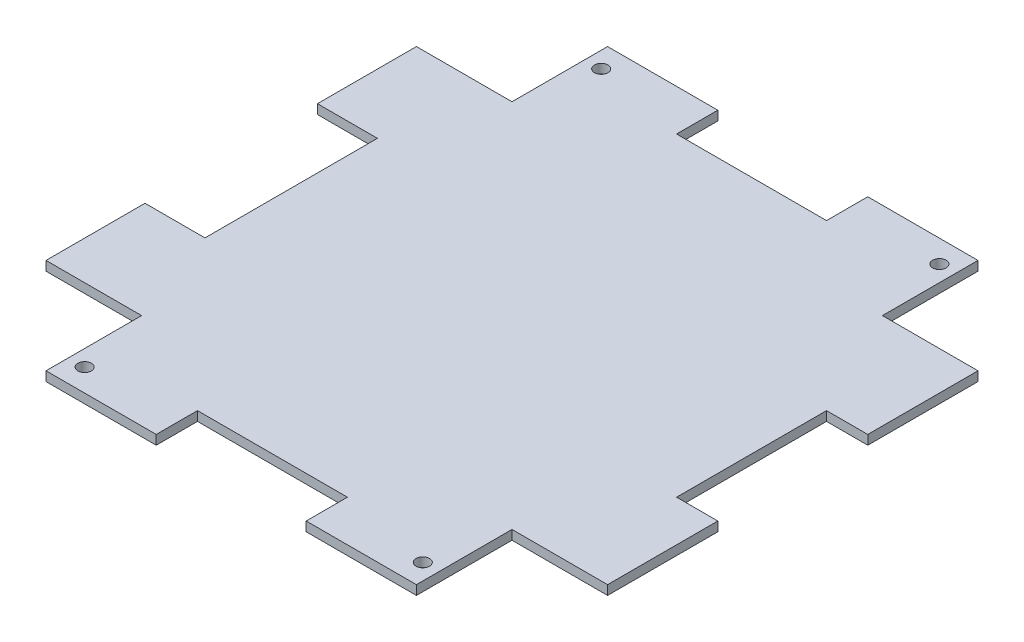
ISO-10303-21;
HEADER;
FILE_DESCRIPTION(('STEP AP214'),'2;1');
FILE_NAME('part.step','',(''),(''),'','','');
FILE_SCHEMA(('AUTOMOTIVE_DESIGN { 1 0 10303 214 1 1 1 1 }'));
ENDSEC;
DATA;
#1=APPLICATION_CONTEXT('core data for automotive mechanical design processes');
#2=APPLICATION_PROTOCOL_DEFINITION('international standard','automotive_design',2000,#1);
#3=PRODUCT_CONTEXT('',#1,'mechanical');
#4=PRODUCT('Part','Part','',(#3));
#5=PRODUCT_RELATED_PRODUCT_CATEGORY('part','',(#4));
#6=PRODUCT_DEFINITION_FORMATION('','',#4);
#7=PRODUCT_DEFINITION_CONTEXT('part definition',#1,'design');
#8=PRODUCT_DEFINITION('design','',#6,#7);
#9=PRODUCT_DEFINITION_SHAPE('','',#8);
#10=(LENGTH_UNIT() NAMED_UNIT(*) SI_UNIT(.MILLI.,.METRE.));
#11=(NAMED_UNIT(*) PLANE_ANGLE_UNIT() SI_UNIT($,.RADIAN.));
#12=(NAMED_UNIT(*) SI_UNIT($,.STERADIAN.) SOLID_ANGLE_UNIT());
#13=UNCERTAINTY_MEASURE_WITH_UNIT(LENGTH_MEASURE(1.E-05),#10,'distance_accuracy_value','');
#14=(GEOMETRIC_REPRESENTATION_CONTEXT(3) GLOBAL_UNCERTAINTY_ASSIGNED_CONTEXT((#13)) GLOBAL_UNIT_ASSIGNED_CONTEXT((#10,
#11,#12)) REPRESENTATION_CONTEXT('',''));
#15=CARTESIAN_POINT('',(0.,0.,0.));
#16=DIRECTION('',(0.,0.,1.));
#17=DIRECTION('',(1.,0.,0.));
#18=AXIS2_PLACEMENT_3D('',#15,#16,#17);
#19=CARTESIAN_POINT('',(-62.22816,3.175,-57.16896));
#20=DIRECTION('',(1.,0.,0.));
#21=DIRECTION('',(0.,0.,-1.));
#22=AXIS2_PLACEMENT_3D('',#19,#20,#21);
#23=PLANE('',#22);
#24=DIRECTION('',(0.,0.,1.));
#25=VECTOR('',#24,1.);
#26=CARTESIAN_POINT('',(-62.22816,0.,-57.16896));
#27=LINE('',#26,#25);
#28=CARTESIAN_POINT('',(-62.22816,0.,-57.16896));
#29=VERTEX_POINT('',#28);
#30=CARTESIAN_POINT('',(-62.22816,0.,-23.63596));
#31=VERTEX_POINT('',#30);
#32=EDGE_CURVE('E250',#29,#31,#27,.T.);
#33=ORIENTED_EDGE('',*,*,#32,.T.);
#34=DIRECTION('',(0.,1.,0.));
#35=VECTOR('',#34,1.);
#36=CARTESIAN_POINT('',(-62.22816,0.,-23.63596));
#37=LINE('',#36,#35);
#38=CARTESIAN_POINT('',(-62.22816,3.175,-23.63596));
#39=VERTEX_POINT('',#38);
#40=EDGE_CURVE('E410',#31,#39,#37,.T.);
#41=ORIENTED_EDGE('',*,*,#40,.T.);
#42=DIRECTION('',(0.,0.,1.));
#43=VECTOR('',#42,1.);
#44=CARTESIAN_POINT('',(-62.22816,3.175,-57.16896));
#45=LINE('',#44,#43);
#46=CARTESIAN_POINT('',(-62.22816,3.175,-57.16896));
#47=VERTEX_POINT('',#46);
#48=EDGE_CURVE('E403',#47,#39,#45,.T.);
#49=ORIENTED_EDGE('',*,*,#48,.F.);
#50=DIRECTION('',(0.,-1.,0.));
#51=VECTOR('',#50,1.);
#52=CARTESIAN_POINT('',(-62.22816,3.175,-57.16896));
#53=LINE('',#52,#51);
#54=EDGE_CURVE('E301',#47,#29,#53,.T.);
#55=ORIENTED_EDGE('',*,*,#54,.T.);
#56=EDGE_LOOP('',(#33,#41,#49,#55));
#57=FACE_BOUND('',#56,.T.);
#58=ADVANCED_FACE('F39',(#57),#23,.F.);
#59=CARTESIAN_POINT('',(-29.84616,3.175,100.69904));
#60=DIRECTION('',(0.,0.,-1.));
#61=DIRECTION('',(-1.,0.,0.));
#62=AXIS2_PLACEMENT_3D('',#59,#60,#61);
#63=PLANE('',#62);
#64=DIRECTION('',(1.,0.,0.));
#65=VECTOR('',#64,1.);
#66=CARTESIAN_POINT('',(-29.84616,3.175,100.69904));
#67=LINE('',#66,#65);
#68=CARTESIAN_POINT('',(58.29684,3.175,100.69904));
#69=VERTEX_POINT('',#68);
#70=CARTESIAN_POINT('',(95.63984,3.175,100.69904));
#71=VERTEX_POINT('',#70);
#72=EDGE_CURVE('E365',#69,#71,#67,.T.);
#73=ORIENTED_EDGE('',*,*,#72,.F.);
#74=DIRECTION('',(0.,1.,0.));
#75=VECTOR('',#74,1.);
#76=CARTESIAN_POINT('',(58.29684,0.,100.69904));
#77=LINE('',#76,#75);
#78=CARTESIAN_POINT('',(58.29684,0.,100.69904));
#79=VERTEX_POINT('',#78);
#80=EDGE_CURVE('E452',#79,#69,#77,.T.);
#81=ORIENTED_EDGE('',*,*,#80,.F.);
#82=DIRECTION('',(1.,0.,0.));
#83=VECTOR('',#82,1.);
#84=CARTESIAN_POINT('',(-29.84616,0.,100.69904));
#85=LINE('',#84,#83);
#86=CARTESIAN_POINT('',(95.63984,0.,100.69904));
#87=VERTEX_POINT('',#86);
#88=EDGE_CURVE('E268',#79,#87,#85,.T.);
#89=ORIENTED_EDGE('',*,*,#88,.T.);
#90=DIRECTION('',(0.,-1.,0.));
#91=VECTOR('',#90,1.);
#92=CARTESIAN_POINT('',(95.63984,3.175,100.69904));
#93=LINE('',#92,#91);
#94=EDGE_CURVE('E333',#71,#87,#93,.T.);
#95=ORIENTED_EDGE('',*,*,#94,.F.);
#96=EDGE_LOOP('',(#73,#81,#89,#95));
#97=FACE_BOUND('',#96,.T.);
#98=ADVANCED_FACE('F580',(#97),#63,.F.);
#99=CARTESIAN_POINT('',(128.02184,3.175,68.31704));
#100=DIRECTION('',(-1.,0.,0.));
#101=DIRECTION('',(0.,0.,1.));
#102=AXIS2_PLACEMENT_3D('',#99,#100,#101);
#103=PLANE('',#102);
#104=DIRECTION('',(0.,0.,-1.));
#105=VECTOR('',#104,1.);
#106=CARTESIAN_POINT('',(128.02184,0.,68.31704));
#107=LINE('',#106,#105);
#108=CARTESIAN_POINT('',(128.02184,0.,68.31704));
#109=VERTEX_POINT('',#108);
#110=CARTESIAN_POINT('',(128.02184,0.,30.97404));
#111=VERTEX_POINT('',#110);
#112=EDGE_CURVE('E280',#109,#111,#107,.T.);
#113=ORIENTED_EDGE('',*,*,#112,.T.);
#114=DIRECTION('',(0.,1.,0.));
#115=VECTOR('',#114,1.);
#116=CARTESIAN_POINT('',(128.02184,0.,30.97404));
#117=LINE('',#116,#115);
#118=CARTESIAN_POINT('',(128.02184,3.175,30.97404));
#119=VERTEX_POINT('',#118);
#120=EDGE_CURVE('E486',#111,#119,#117,.T.);
#121=ORIENTED_EDGE('',*,*,#120,.T.);
#122=DIRECTION('',(0.,0.,-1.));
#123=VECTOR('',#122,1.);
#124=CARTESIAN_POINT('',(128.02184,3.175,68.31704));
#125=LINE('',#124,#123);
#126=CARTESIAN_POINT('',(128.02184,3.175,68.31704));
#127=VERTEX_POINT('',#126);
#128=EDGE_CURVE('E377',#127,#119,#125,.T.);
#129=ORIENTED_EDGE('',*,*,#128,.F.);
#130=DIRECTION('',(0.,-1.,0.));
#131=VECTOR('',#130,1.);
#132=CARTESIAN_POINT('',(128.02184,3.175,68.31704));
#133=LINE('',#132,#131);
#134=EDGE_CURVE('E325',#127,#109,#133,.T.);
#135=ORIENTED_EDGE('',*,*,#134,.T.);
#136=EDGE_LOOP('',(#113,#121,#129,#135));
#137=FACE_BOUND('',#136,.T.);
#138=ADVANCED_FACE('F584',(#137),#103,.F.);
#139=CARTESIAN_POINT('',(95.63984,3.175,-89.55096));
#140=DIRECTION('',(0.,0.,1.));
#141=DIRECTION('',(1.,0.,0.));
#142=AXIS2_PLACEMENT_3D('',#139,#140,#141);
#143=PLANE('',#142);
#144=DIRECTION('',(-1.,0.,0.));
#145=VECTOR('',#144,1.);
#146=CARTESIAN_POINT('',(95.63984,3.175,-89.55096));
#147=LINE('',#146,#145);
#148=CARTESIAN_POINT('',(7.49683999999999,3.175,-89.55096));
#149=VERTEX_POINT('',#148);
#150=CARTESIAN_POINT('',(-29.84616,3.175,-89.55096));
#151=VERTEX_POINT('',#150);
#152=EDGE_CURVE('E387',#149,#151,#147,.T.);
#153=ORIENTED_EDGE('',*,*,#152,.F.);
#154=DIRECTION('',(0.,1.,0.));
#155=VECTOR('',#154,1.);
#156=CARTESIAN_POINT('',(7.49683999999999,0.,-89.55096));
#157=LINE('',#156,#155);
#158=CARTESIAN_POINT('',(7.49683999999999,0.,-89.55096));
#159=VERTEX_POINT('',#158);
#160=EDGE_CURVE('E522',#159,#149,#157,.T.);
#161=ORIENTED_EDGE('',*,*,#160,.F.);
#162=DIRECTION('',(-1.,0.,0.));
#163=VECTOR('',#162,1.);
#164=CARTESIAN_POINT('',(95.63984,0.,-89.55096));
#165=LINE('',#164,#163);
#166=CARTESIAN_POINT('',(-29.84616,0.,-89.55096));
#167=VERTEX_POINT('',#166);
#168=EDGE_CURVE('E290',#159,#167,#165,.T.);
#169=ORIENTED_EDGE('',*,*,#168,.T.);
#170=DIRECTION('',(0.,-1.,0.));
#171=VECTOR('',#170,1.);
#172=CARTESIAN_POINT('',(-29.84616,3.175,-89.55096));
#173=LINE('',#172,#171);
#174=EDGE_CURVE('E309',#151,#167,#173,.T.);
#175=ORIENTED_EDGE('',*,*,#174,.F.);
#176=EDGE_LOOP('',(#153,#161,#169,#175));
#177=FACE_BOUND('',#176,.T.);
#178=ADVANCED_FACE('F589',(#177),#143,.F.);
#179=CARTESIAN_POINT('',(-62.22816,3.175,34.78404));
#180=VERTEX_POINT('',#179);
#181=CARTESIAN_POINT('',(-62.22816,3.175,68.31704));
#182=VERTEX_POINT('',#181);
#183=EDGE_CURVE('E241',#180,#182,#45,.T.);
#184=ORIENTED_EDGE('',*,*,#183,.F.);
#185=DIRECTION('',(0.,1.,0.));
#186=VECTOR('',#185,1.);
#187=CARTESIAN_POINT('',(-62.22816,0.,34.78404));
#188=LINE('',#187,#186);
#189=CARTESIAN_POINT('',(-62.22816,0.,34.78404));
#190=VERTEX_POINT('',#189);
#191=EDGE_CURVE('E228',#190,#180,#188,.T.);
#192=ORIENTED_EDGE('',*,*,#191,.F.);
#193=CARTESIAN_POINT('',(-62.22816,0.,68.31704));
#194=VERTEX_POINT('',#193);
#195=EDGE_CURVE('E239',#190,#194,#27,.T.);
#196=ORIENTED_EDGE('',*,*,#195,.T.);
#197=DIRECTION('',(0.,-1.,0.));
#198=VECTOR('',#197,1.);
#199=CARTESIAN_POINT('',(-62.22816,3.175,68.31704));
#200=LINE('',#199,#198);
#201=EDGE_CURVE('E11',#182,#194,#200,.T.);
#202=ORIENTED_EDGE('',*,*,#201,.F.);
#203=EDGE_LOOP('',(#184,#192,#196,#202));
#204=FACE_BOUND('',#203,.T.);
#205=ADVANCED_FACE('F41',(#204),#23,.F.);
#206=CARTESIAN_POINT('',(-62.22816,3.175,68.31704));
#207=DIRECTION('',(0.,0.,-1.));
#208=DIRECTION('',(-1.,0.,0.));
#209=AXIS2_PLACEMENT_3D('',#206,#207,#208);
#210=PLANE('',#209);
#211=DIRECTION('',(1.,0.,0.));
#212=VECTOR('',#211,1.);
#213=CARTESIAN_POINT('',(-62.22816,0.,68.31704));
#214=LINE('',#213,#212);
#215=CARTESIAN_POINT('',(-29.84616,0.,68.31704));
#216=VERTEX_POINT('',#215);
#217=EDGE_CURVE('E248',#194,#216,#214,.T.);
#218=ORIENTED_EDGE('',*,*,#217,.T.);
#219=DIRECTION('',(0.,-1.,0.));
#220=VECTOR('',#219,1.);
#221=CARTESIAN_POINT('',(-29.84616,3.175,68.31704));
#222=LINE('',#221,#220);
#223=CARTESIAN_POINT('',(-29.84616,3.175,68.31704));
#224=VERTEX_POINT('',#223);
#225=EDGE_CURVE('E48',#224,#216,#222,.T.);
#226=ORIENTED_EDGE('',*,*,#225,.F.);
#227=DIRECTION('',(1.,0.,0.));
#228=VECTOR('',#227,1.);
#229=CARTESIAN_POINT('',(-62.22816,3.175,68.31704));
#230=LINE('',#229,#228);
#231=EDGE_CURVE('E412',#182,#224,#230,.T.);
#232=ORIENTED_EDGE('',*,*,#231,.F.);
#233=ORIENTED_EDGE('',*,*,#201,.T.);
#234=EDGE_LOOP('',(#218,#226,#232,#233));
#235=FACE_BOUND('',#234,.T.);
#236=ADVANCED_FACE('F588',(#235),#210,.F.);
#237=CARTESIAN_POINT('',(-29.84616,3.175,68.31704));
#238=DIRECTION('',(1.,0.,0.));
#239=DIRECTION('',(0.,0.,-1.));
#240=AXIS2_PLACEMENT_3D('',#237,#238,#239);
#241=PLANE('',#240);
#242=DIRECTION('',(0.,0.,1.));
#243=VECTOR('',#242,1.);
#244=CARTESIAN_POINT('',(-29.84616,0.,68.31704));
#245=LINE('',#244,#243);
#246=CARTESIAN_POINT('',(-29.84616,0.,100.69904));
#247=VERTEX_POINT('',#246);
#248=EDGE_CURVE('E265',#216,#247,#245,.T.);
#249=ORIENTED_EDGE('',*,*,#248,.T.);
#250=DIRECTION('',(0.,-1.,0.));
#251=VECTOR('',#250,1.);
#252=CARTESIAN_POINT('',(-29.84616,3.175,100.69904));
#253=LINE('',#252,#251);
#254=CARTESIAN_POINT('',(-29.84616,3.175,100.69904));
#255=VERTEX_POINT('',#254);
#256=EDGE_CURVE('E337',#255,#247,#253,.T.);
#257=ORIENTED_EDGE('',*,*,#256,.F.);
#258=DIRECTION('',(0.,0.,1.));
#259=VECTOR('',#258,1.);
#260=CARTESIAN_POINT('',(-29.84616,3.175,68.31704));
#261=LINE('',#260,#259);
#262=EDGE_CURVE('E347',#224,#255,#261,.T.);
#263=ORIENTED_EDGE('',*,*,#262,.F.);
#264=ORIENTED_EDGE('',*,*,#225,.T.);
#265=EDGE_LOOP('',(#249,#257,#263,#264));
#266=FACE_BOUND('',#265,.T.);
#267=ADVANCED_FACE('F345',(#266),#241,.F.);
#268=CARTESIAN_POINT('',(7.49683999999999,0.,100.69904));
#269=VERTEX_POINT('',#268);
#270=EDGE_CURVE('E269',#247,#269,#85,.T.);
#271=ORIENTED_EDGE('',*,*,#270,.T.);
#272=DIRECTION('',(0.,1.,0.));
#273=VECTOR('',#272,1.);
#274=CARTESIAN_POINT('',(7.49683999999999,0.,100.69904));
#275=LINE('',#274,#273);
#276=CARTESIAN_POINT('',(7.49683999999999,3.175,100.69904));
#277=VERTEX_POINT('',#276);
#278=EDGE_CURVE('E358',#269,#277,#275,.T.);
#279=ORIENTED_EDGE('',*,*,#278,.T.);
#280=EDGE_CURVE('E360',#255,#277,#67,.T.);
#281=ORIENTED_EDGE('',*,*,#280,.F.);
#282=ORIENTED_EDGE('',*,*,#256,.T.);
#283=EDGE_LOOP('',(#271,#279,#281,#282));
#284=FACE_BOUND('',#283,.T.);
#285=ADVANCED_FACE('F356',(#284),#63,.F.);
#286=CARTESIAN_POINT('',(95.63984,3.175,100.69904));
#287=DIRECTION('',(-1.,0.,0.));
#288=DIRECTION('',(0.,0.,1.));
#289=AXIS2_PLACEMENT_3D('',#286,#287,#288);
#290=PLANE('',#289);
#291=DIRECTION('',(0.,0.,-1.));
#292=VECTOR('',#291,1.);
#293=CARTESIAN_POINT('',(95.63984,0.,100.69904));
#294=LINE('',#293,#292);
#295=CARTESIAN_POINT('',(95.63984,0.,68.31704));
#296=VERTEX_POINT('',#295);
#297=EDGE_CURVE('E273',#87,#296,#294,.T.);
#298=ORIENTED_EDGE('',*,*,#297,.T.);
#299=DIRECTION('',(0.,-1.,0.));
#300=VECTOR('',#299,1.);
#301=CARTESIAN_POINT('',(95.63984,3.175,68.31704));
#302=LINE('',#301,#300);
#303=CARTESIAN_POINT('',(95.63984,3.175,68.31704));
#304=VERTEX_POINT('',#303);
#305=EDGE_CURVE('E329',#304,#296,#302,.T.);
#306=ORIENTED_EDGE('',*,*,#305,.F.);
#307=DIRECTION('',(0.,0.,-1.));
#308=VECTOR('',#307,1.);
#309=CARTESIAN_POINT('',(95.63984,3.175,100.69904));
#310=LINE('',#309,#308);
#311=EDGE_CURVE('E364',#71,#304,#310,.T.);
#312=ORIENTED_EDGE('',*,*,#311,.F.);
#313=ORIENTED_EDGE('',*,*,#94,.T.);
#314=EDGE_LOOP('',(#298,#306,#312,#313));
#315=FACE_BOUND('',#314,.T.);
#316=ADVANCED_FACE('F646',(#315),#290,.F.);
#317=CARTESIAN_POINT('',(95.63984,3.175,68.31704));
#318=DIRECTION('',(0.,0.,-1.));
#319=DIRECTION('',(-1.,0.,0.));
#320=AXIS2_PLACEMENT_3D('',#317,#318,#319);
#321=PLANE('',#320);
#322=DIRECTION('',(1.,0.,0.));
#323=VECTOR('',#322,1.);
#324=CARTESIAN_POINT('',(95.63984,0.,68.31704));
#325=LINE('',#324,#323);
#326=EDGE_CURVE('E276',#296,#109,#325,.T.);
#327=ORIENTED_EDGE('',*,*,#326,.T.);
#328=ORIENTED_EDGE('',*,*,#134,.F.);
#329=DIRECTION('',(1.,0.,0.));
#330=VECTOR('',#329,1.);
#331=CARTESIAN_POINT('',(95.63984,3.175,68.31704));
#332=LINE('',#331,#330);
#333=EDGE_CURVE('E369',#304,#127,#332,.T.);
#334=ORIENTED_EDGE('',*,*,#333,.F.);
#335=ORIENTED_EDGE('',*,*,#305,.T.);
#336=EDGE_LOOP('',(#327,#328,#334,#335));
#337=FACE_BOUND('',#336,.T.);
#338=ADVANCED_FACE('F652',(#337),#321,.F.);
#339=CARTESIAN_POINT('',(128.02184,3.175,-19.82596));
#340=VERTEX_POINT('',#339);
#341=CARTESIAN_POINT('',(128.02184,3.175,-57.16896));
#342=VERTEX_POINT('',#341);
#343=EDGE_CURVE('E376',#340,#342,#125,.T.);
#344=ORIENTED_EDGE('',*,*,#343,.F.);
#345=DIRECTION('',(0.,1.,0.));
#346=VECTOR('',#345,1.);
#347=CARTESIAN_POINT('',(128.02184,0.,-19.82596));
#348=LINE('',#347,#346);
#349=CARTESIAN_POINT('',(128.02184,0.,-19.82596));
#350=VERTEX_POINT('',#349);
#351=EDGE_CURVE('E476',#350,#340,#348,.T.);
#352=ORIENTED_EDGE('',*,*,#351,.F.);
#353=CARTESIAN_POINT('',(128.02184,0.,-57.16896));
#354=VERTEX_POINT('',#353);
#355=EDGE_CURVE('E279',#350,#354,#107,.T.);
#356=ORIENTED_EDGE('',*,*,#355,.T.);
#357=DIRECTION('',(0.,-1.,0.));
#358=VECTOR('',#357,1.);
#359=CARTESIAN_POINT('',(128.02184,3.175,-57.16896));
#360=LINE('',#359,#358);
#361=EDGE_CURVE('E321',#342,#354,#360,.T.);
#362=ORIENTED_EDGE('',*,*,#361,.F.);
#363=EDGE_LOOP('',(#344,#352,#356,#362));
#364=FACE_BOUND('',#363,.T.);
#365=ADVANCED_FACE('F602',(#364),#103,.F.);
#366=CARTESIAN_POINT('',(128.02184,3.175,-57.16896));
#367=DIRECTION('',(0.,0.,1.));
#368=DIRECTION('',(1.,0.,0.));
#369=AXIS2_PLACEMENT_3D('',#366,#367,#368);
#370=PLANE('',#369);
#371=DIRECTION('',(-1.,0.,0.));
#372=VECTOR('',#371,1.);
#373=CARTESIAN_POINT('',(128.02184,0.,-57.16896));
#374=LINE('',#373,#372);
#375=CARTESIAN_POINT('',(95.63984,0.,-57.16896));
#376=VERTEX_POINT('',#375);
#377=EDGE_CURVE('E284',#354,#376,#374,.T.);
#378=ORIENTED_EDGE('',*,*,#377,.T.);
#379=DIRECTION('',(0.,-1.,0.));
#380=VECTOR('',#379,1.);
#381=CARTESIAN_POINT('',(95.63984,3.175,-57.16896));
#382=LINE('',#381,#380);
#383=CARTESIAN_POINT('',(95.63984,3.175,-57.16896));
#384=VERTEX_POINT('',#383);
#385=EDGE_CURVE('E317',#384,#376,#382,.T.);
#386=ORIENTED_EDGE('',*,*,#385,.F.);
#387=DIRECTION('',(-1.,0.,0.));
#388=VECTOR('',#387,1.);
#389=CARTESIAN_POINT('',(128.02184,3.175,-57.16896));
#390=LINE('',#389,#388);
#391=EDGE_CURVE('E381',#342,#384,#390,.T.);
#392=ORIENTED_EDGE('',*,*,#391,.F.);
#393=ORIENTED_EDGE('',*,*,#361,.T.);
#394=EDGE_LOOP('',(#378,#386,#392,#393));
#395=FACE_BOUND('',#394,.T.);
#396=ADVANCED_FACE('F615',(#395),#370,.F.);
#397=CARTESIAN_POINT('',(95.63984,3.175,-57.16896));
#398=DIRECTION('',(-1.,0.,0.));
#399=DIRECTION('',(0.,0.,1.));
#400=AXIS2_PLACEMENT_3D('',#397,#398,#399);
#401=PLANE('',#400);
#402=DIRECTION('',(0.,0.,-1.));
#403=VECTOR('',#402,1.);
#404=CARTESIAN_POINT('',(95.63984,0.,-57.16896));
#405=LINE('',#404,#403);
#406=CARTESIAN_POINT('',(95.63984,0.,-89.55096));
#407=VERTEX_POINT('',#406);
#408=EDGE_CURVE('E287',#376,#407,#405,.T.);
#409=ORIENTED_EDGE('',*,*,#408,.T.);
#410=DIRECTION('',(0.,-1.,0.));
#411=VECTOR('',#410,1.);
#412=CARTESIAN_POINT('',(95.63984,3.175,-89.55096));
#413=LINE('',#412,#411);
#414=CARTESIAN_POINT('',(95.63984,3.175,-89.55096));
#415=VERTEX_POINT('',#414);
#416=EDGE_CURVE('E313',#415,#407,#413,.T.);
#417=ORIENTED_EDGE('',*,*,#416,.F.);
#418=DIRECTION('',(0.,0.,-1.));
#419=VECTOR('',#418,1.);
#420=CARTESIAN_POINT('',(95.63984,3.175,-57.16896));
#421=LINE('',#420,#419);
#422=EDGE_CURVE('E384',#384,#415,#421,.T.);
#423=ORIENTED_EDGE('',*,*,#422,.F.);
#424=ORIENTED_EDGE('',*,*,#385,.T.);
#425=EDGE_LOOP('',(#409,#417,#423,#424));
#426=FACE_BOUND('',#425,.T.);
#427=ADVANCED_FACE('F608',(#426),#401,.F.);
#428=CARTESIAN_POINT('',(58.29684,0.,-89.55096));
#429=VERTEX_POINT('',#428);
#430=EDGE_CURVE('E291',#407,#429,#165,.T.);
#431=ORIENTED_EDGE('',*,*,#430,.T.);
#432=DIRECTION('',(0.,1.,0.));
#433=VECTOR('',#432,1.);
#434=CARTESIAN_POINT('',(58.29684,0.,-89.55096));
#435=LINE('',#434,#433);
#436=CARTESIAN_POINT('',(58.29684,3.175,-89.55096));
#437=VERTEX_POINT('',#436);
#438=EDGE_CURVE('E518',#429,#437,#435,.T.);
#439=ORIENTED_EDGE('',*,*,#438,.T.);
#440=EDGE_CURVE('E388',#415,#437,#147,.T.);
#441=ORIENTED_EDGE('',*,*,#440,.F.);
#442=ORIENTED_EDGE('',*,*,#416,.T.);
#443=EDGE_LOOP('',(#431,#439,#441,#442));
#444=FACE_BOUND('',#443,.T.);
#445=ADVANCED_FACE('F596',(#444),#143,.F.);
#446=CARTESIAN_POINT('',(-29.84616,3.175,-89.55096));
#447=DIRECTION('',(1.,0.,0.));
#448=DIRECTION('',(0.,0.,-1.));
#449=AXIS2_PLACEMENT_3D('',#446,#447,#448);
#450=PLANE('',#449);
#451=DIRECTION('',(0.,0.,1.));
#452=VECTOR('',#451,1.);
#453=CARTESIAN_POINT('',(-29.84616,0.,-89.55096));
#454=LINE('',#453,#452);
#455=CARTESIAN_POINT('',(-29.84616,0.,-57.16896));
#456=VERTEX_POINT('',#455);
#457=EDGE_CURVE('E295',#167,#456,#454,.T.);
#458=ORIENTED_EDGE('',*,*,#457,.T.);
#459=DIRECTION('',(0.,-1.,0.));
#460=VECTOR('',#459,1.);
#461=CARTESIAN_POINT('',(-29.84616,3.175,-57.16896));
#462=LINE('',#461,#460);
#463=CARTESIAN_POINT('',(-29.84616,3.175,-57.16896));
#464=VERTEX_POINT('',#463);
#465=EDGE_CURVE('E305',#464,#456,#462,.T.);
#466=ORIENTED_EDGE('',*,*,#465,.F.);
#467=DIRECTION('',(0.,0.,1.));
#468=VECTOR('',#467,1.);
#469=CARTESIAN_POINT('',(-29.84616,3.175,-89.55096));
#470=LINE('',#469,#468);
#471=EDGE_CURVE('E391',#151,#464,#470,.T.);
#472=ORIENTED_EDGE('',*,*,#471,.F.);
#473=ORIENTED_EDGE('',*,*,#174,.T.);
#474=EDGE_LOOP('',(#458,#466,#472,#473));
#475=FACE_BOUND('',#474,.T.);
#476=ADVANCED_FACE('F607',(#475),#450,.F.);
#477=CARTESIAN_POINT('',(-29.84616,3.175,-57.16896));
#478=DIRECTION('',(0.,0.,1.));
#479=DIRECTION('',(1.,0.,0.));
#480=AXIS2_PLACEMENT_3D('',#477,#478,#479);
#481=PLANE('',#480);
#482=DIRECTION('',(-1.,0.,0.));
#483=VECTOR('',#482,1.);
#484=CARTESIAN_POINT('',(-29.84616,0.,-57.16896));
#485=LINE('',#484,#483);
#486=EDGE_CURVE('E298',#456,#29,#485,.T.);
#487=ORIENTED_EDGE('',*,*,#486,.T.);
#488=ORIENTED_EDGE('',*,*,#54,.F.);
#489=DIRECTION('',(-1.,0.,0.));
#490=VECTOR('',#489,1.);
#491=CARTESIAN_POINT('',(-29.84616,3.175,-57.16896));
#492=LINE('',#491,#490);
#493=EDGE_CURVE('E261',#464,#47,#492,.T.);
#494=ORIENTED_EDGE('',*,*,#493,.F.);
#495=ORIENTED_EDGE('',*,*,#465,.T.);
#496=EDGE_LOOP('',(#487,#488,#494,#495));
#497=FACE_BOUND('',#496,.T.);
#498=ADVANCED_FACE('F405',(#497),#481,.F.);
#499=CARTESIAN_POINT('',(0.,3.175,0.));
#500=DIRECTION('',(0.,1.,0.));
#501=DIRECTION('',(0.,0.,1.));
#502=AXIS2_PLACEMENT_3D('',#499,#500,#501);
#503=PLANE('',#502);
#504=DIRECTION('',(-1.,0.,0.));
#505=VECTOR('',#504,1.);
#506=CARTESIAN_POINT('',(-62.22816,3.175,-23.63596));
#507=LINE('',#506,#505);
#508=CARTESIAN_POINT('',(-41.90816,3.175,-23.63596));
#509=VERTEX_POINT('',#508);
#510=EDGE_CURVE('E234',#509,#39,#507,.T.);
#511=ORIENTED_EDGE('',*,*,#510,.F.);
#512=DIRECTION('',(0.,0.,-1.));
#513=VECTOR('',#512,1.);
#514=CARTESIAN_POINT('',(-41.90816,3.175,34.78404));
#515=LINE('',#514,#513);
#516=CARTESIAN_POINT('',(-41.90816,3.175,34.78404));
#517=VERTEX_POINT('',#516);
#518=EDGE_CURVE('E555',#517,#509,#515,.T.);
#519=ORIENTED_EDGE('',*,*,#518,.F.);
#520=DIRECTION('',(1.,0.,0.));
#521=VECTOR('',#520,1.);
#522=CARTESIAN_POINT('',(-62.22816,3.175,34.78404));
#523=LINE('',#522,#521);
#524=EDGE_CURVE('E525',#180,#517,#523,.T.);
#525=ORIENTED_EDGE('',*,*,#524,.F.);
#526=ORIENTED_EDGE('',*,*,#183,.T.);
#527=ORIENTED_EDGE('',*,*,#231,.T.);
#528=ORIENTED_EDGE('',*,*,#262,.T.);
#529=ORIENTED_EDGE('',*,*,#280,.T.);
#530=DIRECTION('',(0.,0.,1.));
#531=VECTOR('',#530,1.);
#532=CARTESIAN_POINT('',(7.49683999999999,3.175,100.69904));
#533=LINE('',#532,#531);
#534=CARTESIAN_POINT('',(7.49683999999999,3.175,86.72904));
#535=VERTEX_POINT('',#534);
#536=EDGE_CURVE('E456',#535,#277,#533,.T.);
#537=ORIENTED_EDGE('',*,*,#536,.F.);
#538=DIRECTION('',(-1.,0.,0.));
#539=VECTOR('',#538,1.);
#540=CARTESIAN_POINT('',(58.29684,3.175,86.72904));
#541=LINE('',#540,#539);
#542=CARTESIAN_POINT('',(58.29684,3.175,86.72904));
#543=VERTEX_POINT('',#542);
#544=EDGE_CURVE('E460',#543,#535,#541,.T.);
#545=ORIENTED_EDGE('',*,*,#544,.F.);
#546=DIRECTION('',(0.,0.,-1.));
#547=VECTOR('',#546,1.);
#548=CARTESIAN_POINT('',(58.29684,3.175,100.69904));
#549=LINE('',#548,#547);
#550=EDGE_CURVE('E464',#69,#543,#549,.T.);
#551=ORIENTED_EDGE('',*,*,#550,.F.);
#552=ORIENTED_EDGE('',*,*,#72,.T.);
#553=ORIENTED_EDGE('',*,*,#311,.T.);
#554=ORIENTED_EDGE('',*,*,#333,.T.);
#555=ORIENTED_EDGE('',*,*,#128,.T.);
#556=DIRECTION('',(1.,0.,0.));
#557=VECTOR('',#556,1.);
#558=CARTESIAN_POINT('',(128.02184,3.175,30.97404));
#559=LINE('',#558,#557);
#560=CARTESIAN_POINT('',(114.05184,3.175,30.97404));
#561=VERTEX_POINT('',#560);
#562=EDGE_CURVE('E491',#561,#119,#559,.T.);
#563=ORIENTED_EDGE('',*,*,#562,.F.);
#564=DIRECTION('',(0.,0.,1.));
#565=VECTOR('',#564,1.);
#566=CARTESIAN_POINT('',(114.05184,3.175,-19.82596));
#567=LINE('',#566,#565);
#568=CARTESIAN_POINT('',(114.05184,3.175,-19.82596));
#569=VERTEX_POINT('',#568);
#570=EDGE_CURVE('E495',#569,#561,#567,.T.);
#571=ORIENTED_EDGE('',*,*,#570,.F.);
#572=DIRECTION('',(-1.,0.,0.));
#573=VECTOR('',#572,1.);
#574=CARTESIAN_POINT('',(128.02184,3.175,-19.82596));
#575=LINE('',#574,#573);
#576=EDGE_CURVE('E455',#340,#569,#575,.T.);
#577=ORIENTED_EDGE('',*,*,#576,.F.);
#578=ORIENTED_EDGE('',*,*,#343,.T.);
#579=ORIENTED_EDGE('',*,*,#391,.T.);
#580=ORIENTED_EDGE('',*,*,#422,.T.);
#581=ORIENTED_EDGE('',*,*,#440,.T.);
#582=DIRECTION('',(0.,0.,-1.));
#583=VECTOR('',#582,1.);
#584=CARTESIAN_POINT('',(58.29684,3.175,-89.55096));
#585=LINE('',#584,#583);
#586=CARTESIAN_POINT('',(58.29684,3.175,-75.58096));
#587=VERTEX_POINT('',#586);
#588=EDGE_CURVE('E526',#587,#437,#585,.T.);
#589=ORIENTED_EDGE('',*,*,#588,.F.);
#590=DIRECTION('',(1.,0.,0.));
#591=VECTOR('',#590,1.);
#592=CARTESIAN_POINT('',(7.49683999999999,3.175,-75.58096));
#593=LINE('',#592,#591);
#594=CARTESIAN_POINT('',(7.49683999999999,3.175,-75.58096));
#595=VERTEX_POINT('',#594);
#596=EDGE_CURVE('E530',#595,#587,#593,.T.);
#597=ORIENTED_EDGE('',*,*,#596,.F.);
#598=DIRECTION('',(0.,0.,1.));
#599=VECTOR('',#598,1.);
#600=CARTESIAN_POINT('',(7.49683999999999,3.175,-89.55096));
#601=LINE('',#600,#599);
#602=EDGE_CURVE('E490',#149,#595,#601,.T.);
#603=ORIENTED_EDGE('',*,*,#602,.F.);
#604=ORIENTED_EDGE('',*,*,#152,.T.);
#605=ORIENTED_EDGE('',*,*,#471,.T.);
#606=ORIENTED_EDGE('',*,*,#493,.T.);
#607=ORIENTED_EDGE('',*,*,#48,.T.);
#608=EDGE_LOOP('',(#511,#519,#525,#526,#527,#528,#529,#537,#545,#551,#552,#553,#554,#555,#563,
#571,#577,#578,#579,#580,#581,#589,#597,#603,#604,#605,#606,#607));
#609=FACE_BOUND('',#608,.T.);
#610=CARTESIAN_POINT('',(-24.38516,3.175,93.07904));
#611=DIRECTION('',(0.,1.,0.));
#612=DIRECTION('',(0.,0.,1.));
#613=AXIS2_PLACEMENT_3D('',#610,#611,#612);
#614=CIRCLE('',#613,2.286);
#615=CARTESIAN_POINT('',(-24.38516,3.175,95.36504));
#616=VERTEX_POINT('',#615);
#617=EDGE_CURVE('E421',#616,#616,#614,.T.);
#618=ORIENTED_EDGE('',*,*,#617,.F.);
#619=EDGE_LOOP('',(#618));
#620=FACE_BOUND('',#619,.T.);
#621=CARTESIAN_POINT('',(90.17884,3.175,93.07904));
#622=DIRECTION('',(0.,1.,0.));
#623=DIRECTION('',(0.,0.,1.));
#624=AXIS2_PLACEMENT_3D('',#621,#622,#623);
#625=CIRCLE('',#624,2.28599999999999);
#626=CARTESIAN_POINT('',(90.17884,3.175,95.36504));
#627=VERTEX_POINT('',#626);
#628=EDGE_CURVE('E429',#627,#627,#625,.T.);
#629=ORIENTED_EDGE('',*,*,#628,.F.);
#630=EDGE_LOOP('',(#629));
#631=FACE_BOUND('',#630,.T.);
#632=CARTESIAN_POINT('',(90.17884,3.175,-81.93096));
#633=DIRECTION('',(0.,1.,0.));
#634=DIRECTION('',(0.,0.,1.));
#635=AXIS2_PLACEMENT_3D('',#632,#633,#634);
#636=CIRCLE('',#635,2.28599999999999);
#637=CARTESIAN_POINT('',(90.17884,3.175,-79.64496));
#638=VERTEX_POINT('',#637);
#639=EDGE_CURVE('E437',#638,#638,#636,.T.);
#640=ORIENTED_EDGE('',*,*,#639,.F.);
#641=EDGE_LOOP('',(#640));
#642=FACE_BOUND('',#641,.T.);
#643=CARTESIAN_POINT('',(-24.38516,3.175,-81.93096));
#644=DIRECTION('',(0.,1.,0.));
#645=DIRECTION('',(0.,0.,1.));
#646=AXIS2_PLACEMENT_3D('',#643,#644,#645);
#647=CIRCLE('',#646,2.286);
#648=CARTESIAN_POINT('',(-24.38516,3.175,-79.64496));
#649=VERTEX_POINT('',#648);
#650=EDGE_CURVE('E257',#649,#649,#647,.T.);
#651=ORIENTED_EDGE('',*,*,#650,.F.);
#652=EDGE_LOOP('',(#651));
#653=FACE_BOUND('',#652,.T.);
#654=ADVANCED_FACE('F400',(#609,#620,#631,#642,#653),#503,.T.);
#655=CARTESIAN_POINT('',(0.,0.,0.));
#656=DIRECTION('',(0.,1.,0.));
#657=DIRECTION('',(0.,0.,1.));
#658=AXIS2_PLACEMENT_3D('',#655,#656,#657);
#659=PLANE('',#658);
#660=DIRECTION('',(0.,0.,-1.));
#661=VECTOR('',#660,1.);
#662=CARTESIAN_POINT('',(-41.90816,0.,34.78404));
#663=LINE('',#662,#661);
#664=CARTESIAN_POINT('',(-41.90816,0.,34.78404));
#665=VERTEX_POINT('',#664);
#666=CARTESIAN_POINT('',(-41.90816,0.,-23.63596));
#667=VERTEX_POINT('',#666);
#668=EDGE_CURVE('E55',#665,#667,#663,.T.);
#669=ORIENTED_EDGE('',*,*,#668,.T.);
#670=DIRECTION('',(-1.,0.,0.));
#671=VECTOR('',#670,1.);
#672=CARTESIAN_POINT('',(-62.22816,0.,-23.63596));
#673=LINE('',#672,#671);
#674=EDGE_CURVE('E243',#667,#31,#673,.T.);
#675=ORIENTED_EDGE('',*,*,#674,.T.);
#676=ORIENTED_EDGE('',*,*,#32,.F.);
#677=ORIENTED_EDGE('',*,*,#486,.F.);
#678=ORIENTED_EDGE('',*,*,#457,.F.);
#679=ORIENTED_EDGE('',*,*,#168,.F.);
#680=DIRECTION('',(0.,0.,1.));
#681=VECTOR('',#680,1.);
#682=CARTESIAN_POINT('',(7.49683999999999,0.,-89.55096));
#683=LINE('',#682,#681);
#684=CARTESIAN_POINT('',(7.49683999999999,0.,-75.58096));
#685=VERTEX_POINT('',#684);
#686=EDGE_CURVE('E529',#159,#685,#683,.T.);
#687=ORIENTED_EDGE('',*,*,#686,.T.);
#688=DIRECTION('',(1.,0.,0.));
#689=VECTOR('',#688,1.);
#690=CARTESIAN_POINT('',(7.49683999999999,0.,-75.58096));
#691=LINE('',#690,#689);
#692=CARTESIAN_POINT('',(58.29684,0.,-75.58096));
#693=VERTEX_POINT('',#692);
#694=EDGE_CURVE('E539',#685,#693,#691,.T.);
#695=ORIENTED_EDGE('',*,*,#694,.T.);
#696=DIRECTION('',(0.,0.,-1.));
#697=VECTOR('',#696,1.);
#698=CARTESIAN_POINT('',(58.29684,0.,-89.55096));
#699=LINE('',#698,#697);
#700=EDGE_CURVE('E63',#693,#429,#699,.T.);
#701=ORIENTED_EDGE('',*,*,#700,.T.);
#702=ORIENTED_EDGE('',*,*,#430,.F.);
#703=ORIENTED_EDGE('',*,*,#408,.F.);
#704=ORIENTED_EDGE('',*,*,#377,.F.);
#705=ORIENTED_EDGE('',*,*,#355,.F.);
#706=DIRECTION('',(-1.,0.,0.));
#707=VECTOR('',#706,1.);
#708=CARTESIAN_POINT('',(128.02184,0.,-19.82596));
#709=LINE('',#708,#707);
#710=CARTESIAN_POINT('',(114.05184,0.,-19.82596));
#711=VERTEX_POINT('',#710);
#712=EDGE_CURVE('E494',#350,#711,#709,.T.);
#713=ORIENTED_EDGE('',*,*,#712,.T.);
#714=DIRECTION('',(0.,0.,1.));
#715=VECTOR('',#714,1.);
#716=CARTESIAN_POINT('',(114.05184,0.,-19.82596));
#717=LINE('',#716,#715);
#718=CARTESIAN_POINT('',(114.05184,0.,30.97404));
#719=VERTEX_POINT('',#718);
#720=EDGE_CURVE('E505',#711,#719,#717,.T.);
#721=ORIENTED_EDGE('',*,*,#720,.T.);
#722=DIRECTION('',(1.,0.,0.));
#723=VECTOR('',#722,1.);
#724=CARTESIAN_POINT('',(128.02184,0.,30.97404));
#725=LINE('',#724,#723);
#726=EDGE_CURVE('E480',#719,#111,#725,.T.);
#727=ORIENTED_EDGE('',*,*,#726,.T.);
#728=ORIENTED_EDGE('',*,*,#112,.F.);
#729=ORIENTED_EDGE('',*,*,#326,.F.);
#730=ORIENTED_EDGE('',*,*,#297,.F.);
#731=ORIENTED_EDGE('',*,*,#88,.F.);
#732=DIRECTION('',(0.,0.,-1.));
#733=VECTOR('',#732,1.);
#734=CARTESIAN_POINT('',(58.29684,0.,100.69904));
#735=LINE('',#734,#733);
#736=CARTESIAN_POINT('',(58.29684,0.,86.72904));
#737=VERTEX_POINT('',#736);
#738=EDGE_CURVE('E459',#79,#737,#735,.T.);
#739=ORIENTED_EDGE('',*,*,#738,.T.);
#740=DIRECTION('',(-1.,0.,0.));
#741=VECTOR('',#740,1.);
#742=CARTESIAN_POINT('',(58.29684,0.,86.72904));
#743=LINE('',#742,#741);
#744=CARTESIAN_POINT('',(7.49683999999999,0.,86.72904));
#745=VERTEX_POINT('',#744);
#746=EDGE_CURVE('E470',#737,#745,#743,.T.);
#747=ORIENTED_EDGE('',*,*,#746,.T.);
#748=DIRECTION('',(0.,0.,1.));
#749=VECTOR('',#748,1.);
#750=CARTESIAN_POINT('',(7.49683999999999,0.,100.69904));
#751=LINE('',#750,#749);
#752=EDGE_CURVE('E353',#745,#269,#751,.T.);
#753=ORIENTED_EDGE('',*,*,#752,.T.);
#754=ORIENTED_EDGE('',*,*,#270,.F.);
#755=ORIENTED_EDGE('',*,*,#248,.F.);
#756=ORIENTED_EDGE('',*,*,#217,.F.);
#757=ORIENTED_EDGE('',*,*,#195,.F.);
#758=DIRECTION('',(1.,0.,0.));
#759=VECTOR('',#758,1.);
#760=CARTESIAN_POINT('',(-62.22816,0.,34.78404));
#761=LINE('',#760,#759);
#762=EDGE_CURVE('E224',#190,#665,#761,.T.);
#763=ORIENTED_EDGE('',*,*,#762,.T.);
#764=EDGE_LOOP('',(#669,#675,#676,#677,#678,#679,#687,#695,#701,#702,#703,#704,#705,#713,#721,
#727,#728,#729,#730,#731,#739,#747,#753,#754,#755,#756,#757,#763));
#765=FACE_BOUND('',#764,.T.);
#766=CARTESIAN_POINT('',(-24.38516,0.,93.07904));
#767=DIRECTION('',(0.,1.,0.));
#768=DIRECTION('',(0.,0.,1.));
#769=AXIS2_PLACEMENT_3D('',#766,#767,#768);
#770=CIRCLE('',#769,2.286);
#771=CARTESIAN_POINT('',(-24.38516,0.,95.36504));
#772=VERTEX_POINT('',#771);
#773=EDGE_CURVE('E425',#772,#772,#770,.T.);
#774=ORIENTED_EDGE('',*,*,#773,.T.);
#775=EDGE_LOOP('',(#774));
#776=FACE_BOUND('',#775,.T.);
#777=CARTESIAN_POINT('',(90.17884,0.,93.07904));
#778=DIRECTION('',(0.,1.,0.));
#779=DIRECTION('',(0.,0.,1.));
#780=AXIS2_PLACEMENT_3D('',#777,#778,#779);
#781=CIRCLE('',#780,2.28599999999999);
#782=CARTESIAN_POINT('',(90.17884,0.,95.36504));
#783=VERTEX_POINT('',#782);
#784=EDGE_CURVE('E433',#783,#783,#781,.T.);
#785=ORIENTED_EDGE('',*,*,#784,.T.);
#786=EDGE_LOOP('',(#785));
#787=FACE_BOUND('',#786,.T.);
#788=CARTESIAN_POINT('',(90.17884,0.,-81.93096));
#789=DIRECTION('',(0.,1.,0.));
#790=DIRECTION('',(0.,0.,1.));
#791=AXIS2_PLACEMENT_3D('',#788,#789,#790);
#792=CIRCLE('',#791,2.28599999999999);
#793=CARTESIAN_POINT('',(90.17884,0.,-79.64496));
#794=VERTEX_POINT('',#793);
#795=EDGE_CURVE('E419',#794,#794,#792,.T.);
#796=ORIENTED_EDGE('',*,*,#795,.T.);
#797=EDGE_LOOP('',(#796));
#798=FACE_BOUND('',#797,.T.);
#799=CARTESIAN_POINT('',(-24.38516,0.,-81.93096));
#800=DIRECTION('',(0.,1.,0.));
#801=DIRECTION('',(0.,0.,1.));
#802=AXIS2_PLACEMENT_3D('',#799,#800,#801);
#803=CIRCLE('',#802,2.286);
#804=CARTESIAN_POINT('',(-24.38516,0.,-79.64496));
#805=VERTEX_POINT('',#804);
#806=EDGE_CURVE('E251',#805,#805,#803,.T.);
#807=ORIENTED_EDGE('',*,*,#806,.T.);
#808=EDGE_LOOP('',(#807));
#809=FACE_BOUND('',#808,.T.);
#810=ADVANCED_FACE('F245',(#765,#776,#787,#798,#809),#659,.F.);
#811=CARTESIAN_POINT('',(-24.38516,0.,-81.93096));
#812=DIRECTION('',(0.,1.,0.));
#813=DIRECTION('',(0.,0.,1.));
#814=AXIS2_PLACEMENT_3D('',#811,#812,#813);
#815=CYLINDRICAL_SURFACE('',#814,2.286);
#816=ORIENTED_EDGE('',*,*,#806,.F.);
#817=EDGE_LOOP('',(#816));
#818=FACE_BOUND('',#817,.T.);
#819=ORIENTED_EDGE('',*,*,#650,.T.);
#820=EDGE_LOOP('',(#819));
#821=FACE_BOUND('',#820,.T.);
#822=ADVANCED_FACE('F685',(#818,#821),#815,.F.);
#823=CARTESIAN_POINT('',(90.17884,0.,-81.93096));
#824=DIRECTION('',(0.,1.,0.));
#825=DIRECTION('',(0.,0.,1.));
#826=AXIS2_PLACEMENT_3D('',#823,#824,#825);
#827=CYLINDRICAL_SURFACE('',#826,2.28599999999999);
#828=ORIENTED_EDGE('',*,*,#795,.F.);
#829=EDGE_LOOP('',(#828));
#830=FACE_BOUND('',#829,.T.);
#831=ORIENTED_EDGE('',*,*,#639,.T.);
#832=EDGE_LOOP('',(#831));
#833=FACE_BOUND('',#832,.T.);
#834=ADVANCED_FACE('F681',(#830,#833),#827,.F.);
#835=CARTESIAN_POINT('',(90.17884,0.,93.07904));
#836=DIRECTION('',(0.,1.,0.));
#837=DIRECTION('',(0.,0.,1.));
#838=AXIS2_PLACEMENT_3D('',#835,#836,#837);
#839=CYLINDRICAL_SURFACE('',#838,2.28599999999999);
#840=ORIENTED_EDGE('',*,*,#784,.F.);
#841=EDGE_LOOP('',(#840));
#842=FACE_BOUND('',#841,.T.);
#843=ORIENTED_EDGE('',*,*,#628,.T.);
#844=EDGE_LOOP('',(#843));
#845=FACE_BOUND('',#844,.T.);
#846=ADVANCED_FACE('F684',(#842,#845),#839,.F.);
#847=CARTESIAN_POINT('',(-24.38516,0.,93.07904));
#848=DIRECTION('',(0.,1.,0.));
#849=DIRECTION('',(0.,0.,1.));
#850=AXIS2_PLACEMENT_3D('',#847,#848,#849);
#851=CYLINDRICAL_SURFACE('',#850,2.286);
#852=ORIENTED_EDGE('',*,*,#773,.F.);
#853=EDGE_LOOP('',(#852));
#854=FACE_BOUND('',#853,.T.);
#855=ORIENTED_EDGE('',*,*,#617,.T.);
#856=EDGE_LOOP('',(#855));
#857=FACE_BOUND('',#856,.T.);
#858=ADVANCED_FACE('F675',(#854,#857),#851,.F.);
#859=CARTESIAN_POINT('',(58.29684,0.,100.69904));
#860=DIRECTION('',(1.,0.,0.));
#861=DIRECTION('',(0.,0.,-1.));
#862=AXIS2_PLACEMENT_3D('',#859,#860,#861);
#863=PLANE('',#862);
#864=ORIENTED_EDGE('',*,*,#550,.T.);
#865=DIRECTION('',(0.,1.,0.));
#866=VECTOR('',#865,1.);
#867=CARTESIAN_POINT('',(58.29684,0.,86.72904));
#868=LINE('',#867,#866);
#869=EDGE_CURVE('E444',#737,#543,#868,.T.);
#870=ORIENTED_EDGE('',*,*,#869,.F.);
#871=ORIENTED_EDGE('',*,*,#738,.F.);
#872=ORIENTED_EDGE('',*,*,#80,.T.);
#873=EDGE_LOOP('',(#864,#870,#871,#872));
#874=FACE_BOUND('',#873,.T.);
#875=ADVANCED_FACE('F660',(#874),#863,.F.);
#876=CARTESIAN_POINT('',(7.49683999999999,0.,100.69904));
#877=DIRECTION('',(-1.,0.,0.));
#878=DIRECTION('',(0.,0.,1.));
#879=AXIS2_PLACEMENT_3D('',#876,#877,#878);
#880=PLANE('',#879);
#881=ORIENTED_EDGE('',*,*,#536,.T.);
#882=ORIENTED_EDGE('',*,*,#278,.F.);
#883=ORIENTED_EDGE('',*,*,#752,.F.);
#884=DIRECTION('',(0.,1.,0.));
#885=VECTOR('',#884,1.);
#886=CARTESIAN_POINT('',(7.49683999999999,0.,86.72904));
#887=LINE('',#886,#885);
#888=EDGE_CURVE('E447',#745,#535,#887,.T.);
#889=ORIENTED_EDGE('',*,*,#888,.T.);
#890=EDGE_LOOP('',(#881,#882,#883,#889));
#891=FACE_BOUND('',#890,.T.);
#892=ADVANCED_FACE('F666',(#891),#880,.F.);
#893=CARTESIAN_POINT('',(58.29684,0.,86.72904));
#894=DIRECTION('',(0.,0.,-1.));
#895=DIRECTION('',(-1.,0.,0.));
#896=AXIS2_PLACEMENT_3D('',#893,#894,#895);
#897=PLANE('',#896);
#898=ORIENTED_EDGE('',*,*,#544,.T.);
#899=ORIENTED_EDGE('',*,*,#888,.F.);
#900=ORIENTED_EDGE('',*,*,#746,.F.);
#901=ORIENTED_EDGE('',*,*,#869,.T.);
#902=EDGE_LOOP('',(#898,#899,#900,#901));
#903=FACE_BOUND('',#902,.T.);
#904=ADVANCED_FACE('F664',(#903),#897,.F.);
#905=CARTESIAN_POINT('',(128.02184,0.,30.97404));
#906=DIRECTION('',(0.,0.,1.));
#907=DIRECTION('',(1.,0.,0.));
#908=AXIS2_PLACEMENT_3D('',#905,#906,#907);
#909=PLANE('',#908);
#910=ORIENTED_EDGE('',*,*,#562,.T.);
#911=ORIENTED_EDGE('',*,*,#120,.F.);
#912=ORIENTED_EDGE('',*,*,#726,.F.);
#913=DIRECTION('',(0.,1.,0.));
#914=VECTOR('',#913,1.);
#915=CARTESIAN_POINT('',(114.05184,0.,30.97404));
#916=LINE('',#915,#914);
#917=EDGE_CURVE('E483',#719,#561,#916,.T.);
#918=ORIENTED_EDGE('',*,*,#917,.T.);
#919=EDGE_LOOP('',(#910,#911,#912,#918));
#920=FACE_BOUND('',#919,.T.);
#921=ADVANCED_FACE('F673',(#920),#909,.F.);
#922=CARTESIAN_POINT('',(114.05184,0.,-19.82596));
#923=DIRECTION('',(-1.,0.,0.));
#924=DIRECTION('',(0.,0.,1.));
#925=AXIS2_PLACEMENT_3D('',#922,#923,#924);
#926=PLANE('',#925);
#927=ORIENTED_EDGE('',*,*,#570,.T.);
#928=ORIENTED_EDGE('',*,*,#917,.F.);
#929=ORIENTED_EDGE('',*,*,#720,.F.);
#930=DIRECTION('',(0.,1.,0.));
#931=VECTOR('',#930,1.);
#932=CARTESIAN_POINT('',(114.05184,0.,-19.82596));
#933=LINE('',#932,#931);
#934=EDGE_CURVE('E479',#711,#569,#933,.T.);
#935=ORIENTED_EDGE('',*,*,#934,.T.);
#936=EDGE_LOOP('',(#927,#928,#929,#935));
#937=FACE_BOUND('',#936,.T.);
#938=ADVANCED_FACE('F753',(#937),#926,.F.);
#939=CARTESIAN_POINT('',(128.02184,0.,-19.82596));
#940=DIRECTION('',(0.,0.,-1.));
#941=DIRECTION('',(-1.,0.,0.));
#942=AXIS2_PLACEMENT_3D('',#939,#940,#941);
#943=PLANE('',#942);
#944=ORIENTED_EDGE('',*,*,#576,.T.);
#945=ORIENTED_EDGE('',*,*,#934,.F.);
#946=ORIENTED_EDGE('',*,*,#712,.F.);
#947=ORIENTED_EDGE('',*,*,#351,.T.);
#948=EDGE_LOOP('',(#944,#945,#946,#947));
#949=FACE_BOUND('',#948,.T.);
#950=ADVANCED_FACE('F678',(#949),#943,.F.);
#951=CARTESIAN_POINT('',(7.49683999999999,0.,-89.55096));
#952=DIRECTION('',(-1.,0.,0.));
#953=DIRECTION('',(0.,0.,1.));
#954=AXIS2_PLACEMENT_3D('',#951,#952,#953);
#955=PLANE('',#954);
#956=ORIENTED_EDGE('',*,*,#602,.T.);
#957=DIRECTION('',(0.,1.,0.));
#958=VECTOR('',#957,1.);
#959=CARTESIAN_POINT('',(7.49683999999999,0.,-75.58096));
#960=LINE('',#959,#958);
#961=EDGE_CURVE('E512',#685,#595,#960,.T.);
#962=ORIENTED_EDGE('',*,*,#961,.F.);
#963=ORIENTED_EDGE('',*,*,#686,.F.);
#964=ORIENTED_EDGE('',*,*,#160,.T.);
#965=EDGE_LOOP('',(#956,#962,#963,#964));
#966=FACE_BOUND('',#965,.T.);
#967=ADVANCED_FACE('F771',(#966),#955,.F.);
#968=CARTESIAN_POINT('',(58.29684,0.,-89.55096));
#969=DIRECTION('',(1.,0.,0.));
#970=DIRECTION('',(0.,0.,-1.));
#971=AXIS2_PLACEMENT_3D('',#968,#969,#970);
#972=PLANE('',#971);
#973=ORIENTED_EDGE('',*,*,#588,.T.);
#974=ORIENTED_EDGE('',*,*,#438,.F.);
#975=ORIENTED_EDGE('',*,*,#700,.F.);
#976=DIRECTION('',(0.,1.,0.));
#977=VECTOR('',#976,1.);
#978=CARTESIAN_POINT('',(58.29684,0.,-75.58096));
#979=LINE('',#978,#977);
#980=EDGE_CURVE('E515',#693,#587,#979,.T.);
#981=ORIENTED_EDGE('',*,*,#980,.T.);
#982=EDGE_LOOP('',(#973,#974,#975,#981));
#983=FACE_BOUND('',#982,.T.);
#984=ADVANCED_FACE('F627',(#983),#972,.F.);
#985=CARTESIAN_POINT('',(7.49683999999999,0.,-75.58096));
#986=DIRECTION('',(0.,0.,1.));
#987=DIRECTION('',(1.,0.,0.));
#988=AXIS2_PLACEMENT_3D('',#985,#986,#987);
#989=PLANE('',#988);
#990=ORIENTED_EDGE('',*,*,#596,.T.);
#991=ORIENTED_EDGE('',*,*,#980,.F.);
#992=ORIENTED_EDGE('',*,*,#694,.F.);
#993=ORIENTED_EDGE('',*,*,#961,.T.);
#994=EDGE_LOOP('',(#990,#991,#992,#993));
#995=FACE_BOUND('',#994,.T.);
#996=ADVANCED_FACE('F577',(#995),#989,.F.);
#997=CARTESIAN_POINT('',(-62.22816,0.,-23.63596));
#998=DIRECTION('',(0.,0.,-1.));
#999=DIRECTION('',(-1.,0.,0.));
#1000=AXIS2_PLACEMENT_3D('',#997,#998,#999);
#1001=PLANE('',#1000);
#1002=ORIENTED_EDGE('',*,*,#510,.T.);
#1003=ORIENTED_EDGE('',*,*,#40,.F.);
#1004=ORIENTED_EDGE('',*,*,#674,.F.);
#1005=DIRECTION('',(0.,1.,0.));
#1006=VECTOR('',#1005,1.);
#1007=CARTESIAN_POINT('',(-41.90816,0.,-23.63596));
#1008=LINE('',#1007,#1006);
#1009=EDGE_CURVE('E548',#667,#509,#1008,.T.);
#1010=ORIENTED_EDGE('',*,*,#1009,.T.);
#1011=EDGE_LOOP('',(#1002,#1003,#1004,#1010));
#1012=FACE_BOUND('',#1011,.T.);
#1013=ADVANCED_FACE('F567',(#1012),#1001,.F.);
#1014=CARTESIAN_POINT('',(-41.90816,0.,34.78404));
#1015=DIRECTION('',(1.,0.,0.));
#1016=DIRECTION('',(0.,0.,-1.));
#1017=AXIS2_PLACEMENT_3D('',#1014,#1015,#1016);
#1018=PLANE('',#1017);
#1019=ORIENTED_EDGE('',*,*,#518,.T.);
#1020=ORIENTED_EDGE('',*,*,#1009,.F.);
#1021=ORIENTED_EDGE('',*,*,#668,.F.);
#1022=DIRECTION('',(0.,1.,0.));
#1023=VECTOR('',#1022,1.);
#1024=CARTESIAN_POINT('',(-41.90816,0.,34.78404));
#1025=LINE('',#1024,#1023);
#1026=EDGE_CURVE('E230',#665,#517,#1025,.T.);
#1027=ORIENTED_EDGE('',*,*,#1026,.T.);
#1028=EDGE_LOOP('',(#1019,#1020,#1021,#1027));
#1029=FACE_BOUND('',#1028,.T.);
#1030=ADVANCED_FACE('F569',(#1029),#1018,.F.);
#1031=CARTESIAN_POINT('',(-62.22816,0.,34.78404));
#1032=DIRECTION('',(0.,0.,1.));
#1033=DIRECTION('',(1.,0.,0.));
#1034=AXIS2_PLACEMENT_3D('',#1031,#1032,#1033);
#1035=PLANE('',#1034);
#1036=ORIENTED_EDGE('',*,*,#524,.T.);
#1037=ORIENTED_EDGE('',*,*,#1026,.F.);
#1038=ORIENTED_EDGE('',*,*,#762,.F.);
#1039=ORIENTED_EDGE('',*,*,#191,.T.);
#1040=EDGE_LOOP('',(#1036,#1037,#1038,#1039));
#1041=FACE_BOUND('',#1040,.T.);
#1042=ADVANCED_FACE('F227',(#1041),#1035,.F.);
#1043=CLOSED_SHELL('',(#58,#98,#138,#178,#205,#236,#267,#285,#316,#338,#365,#396,#427,#445,#476,
#498,#654,#810,#822,#834,#846,#858,#875,#892,#904,#921,#938,#950,#967,#984,#996,#1013,#1030,#1042));
#1044=MANIFOLD_SOLID_BREP('B2',#1043);
#1045=ADVANCED_BREP_SHAPE_REPRESENTATION('',(#18,#1044),#14);
#1046=SHAPE_DEFINITION_REPRESENTATION(#9,#1045);
ENDSEC;
END-ISO-10303-21;
